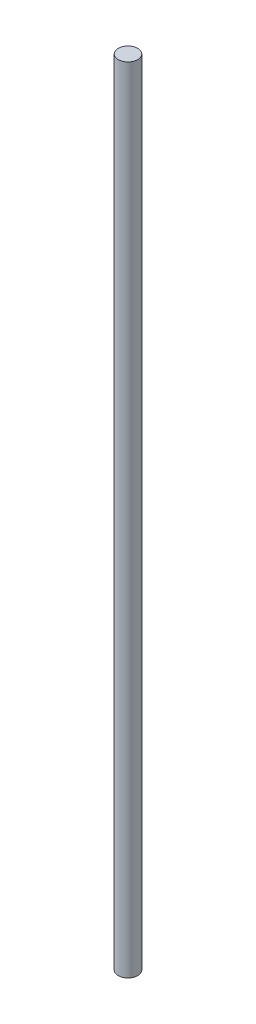
ISO-10303-21;
HEADER;
FILE_DESCRIPTION(('STEP AP214'),'2;1');
FILE_NAME('part.step','',(''),(''),'','','');
FILE_SCHEMA(('AUTOMOTIVE_DESIGN { 1 0 10303 214 1 1 1 1 }'));
ENDSEC;
DATA;
#1=APPLICATION_CONTEXT('core data for automotive mechanical design processes');
#2=APPLICATION_PROTOCOL_DEFINITION('international standard','automotive_design',2000,#1);
#3=PRODUCT_CONTEXT('',#1,'mechanical');
#4=PRODUCT('Part','Part','',(#3));
#5=PRODUCT_RELATED_PRODUCT_CATEGORY('part','',(#4));
#6=PRODUCT_DEFINITION_FORMATION('','',#4);
#7=PRODUCT_DEFINITION_CONTEXT('part definition',#1,'design');
#8=PRODUCT_DEFINITION('design','',#6,#7);
#9=PRODUCT_DEFINITION_SHAPE('','',#8);
#10=(LENGTH_UNIT() NAMED_UNIT(*) SI_UNIT(.MILLI.,.METRE.));
#11=(NAMED_UNIT(*) PLANE_ANGLE_UNIT() SI_UNIT($,.RADIAN.));
#12=(NAMED_UNIT(*) SI_UNIT($,.STERADIAN.) SOLID_ANGLE_UNIT());
#13=UNCERTAINTY_MEASURE_WITH_UNIT(LENGTH_MEASURE(1.E-05),#10,'distance_accuracy_value','');
#14=(GEOMETRIC_REPRESENTATION_CONTEXT(3) GLOBAL_UNCERTAINTY_ASSIGNED_CONTEXT((#13)) GLOBAL_UNIT_ASSIGNED_CONTEXT((#10,
#11,#12)) REPRESENTATION_CONTEXT('',''));
#15=CARTESIAN_POINT('',(0.,0.,0.));
#16=DIRECTION('',(0.,0.,1.));
#17=DIRECTION('',(1.,0.,0.));
#18=AXIS2_PLACEMENT_3D('',#15,#16,#17);
#19=CARTESIAN_POINT('',(0.,387.35,0.));
#20=DIRECTION('',(0.,-1.,0.));
#21=DIRECTION('',(0.,0.,-1.));
#22=AXIS2_PLACEMENT_3D('',#19,#20,#21);
#23=CYLINDRICAL_SURFACE('',#22,4.7625);
#24=CARTESIAN_POINT('',(0.,387.35,0.));
#25=DIRECTION('',(0.,1.,0.));
#26=DIRECTION('',(0.,0.,1.));
#27=AXIS2_PLACEMENT_3D('',#24,#25,#26);
#28=CIRCLE('',#27,4.7625);
#29=CARTESIAN_POINT('',(0.,387.35,4.7625));
#30=VERTEX_POINT('',#29);
#31=EDGE_CURVE('E10',#30,#30,#28,.T.);
#32=ORIENTED_EDGE('',*,*,#31,.F.);
#33=EDGE_LOOP('',(#32));
#34=FACE_BOUND('',#33,.T.);
#35=CARTESIAN_POINT('',(0.,0.,0.));
#36=DIRECTION('',(0.,1.,0.));
#37=DIRECTION('',(0.,0.,1.));
#38=AXIS2_PLACEMENT_3D('',#35,#36,#37);
#39=CIRCLE('',#38,4.7625);
#40=CARTESIAN_POINT('',(0.,0.,4.7625));
#41=VERTEX_POINT('',#40);
#42=EDGE_CURVE('E38',#41,#41,#39,.T.);
#43=ORIENTED_EDGE('',*,*,#42,.T.);
#44=EDGE_LOOP('',(#43));
#45=FACE_BOUND('',#44,.T.);
#46=ADVANCED_FACE('F35',(#34,#45),#23,.T.);
#47=CARTESIAN_POINT('',(0.,387.35,0.));
#48=DIRECTION('',(0.,1.,0.));
#49=DIRECTION('',(0.,0.,1.));
#50=AXIS2_PLACEMENT_3D('',#47,#48,#49);
#51=PLANE('',#50);
#52=ORIENTED_EDGE('',*,*,#31,.T.);
#53=EDGE_LOOP('',(#52));
#54=FACE_BOUND('',#53,.T.);
#55=ADVANCED_FACE('F50',(#54),#51,.T.);
#56=CARTESIAN_POINT('',(0.,0.,0.));
#57=DIRECTION('',(0.,1.,0.));
#58=DIRECTION('',(0.,0.,1.));
#59=AXIS2_PLACEMENT_3D('',#56,#57,#58);
#60=PLANE('',#59);
#61=ORIENTED_EDGE('',*,*,#42,.F.);
#62=EDGE_LOOP('',(#61));
#63=FACE_BOUND('',#62,.T.);
#64=ADVANCED_FACE('F48',(#63),#60,.F.);
#65=CLOSED_SHELL('',(#46,#55,#64));
#66=MANIFOLD_SOLID_BREP('B2',#65);
#67=ADVANCED_BREP_SHAPE_REPRESENTATION('',(#18,#66),#14);
#68=SHAPE_DEFINITION_REPRESENTATION(#9,#67);
ENDSEC;
END-ISO-10303-21;
